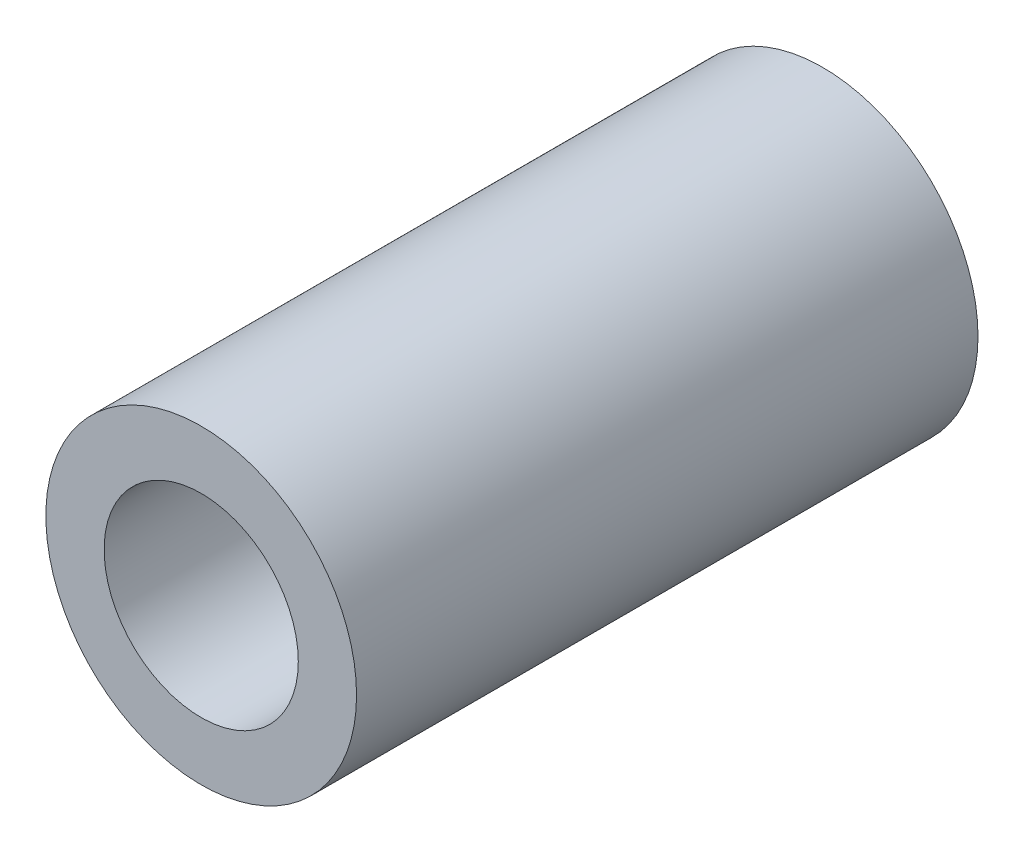
ISO-10303-21;
HEADER;
FILE_DESCRIPTION(('STEP AP214'),'2;1');
FILE_NAME('part.step','',(''),(''),'','','');
FILE_SCHEMA(('AUTOMOTIVE_DESIGN { 1 0 10303 214 1 1 1 1 }'));
ENDSEC;
DATA;
#1=APPLICATION_CONTEXT('core data for automotive mechanical design processes');
#2=APPLICATION_PROTOCOL_DEFINITION('international standard','automotive_design',2000,#1);
#3=PRODUCT_CONTEXT('',#1,'mechanical');
#4=PRODUCT('Part','Part','',(#3));
#5=PRODUCT_RELATED_PRODUCT_CATEGORY('part','',(#4));
#6=PRODUCT_DEFINITION_FORMATION('','',#4);
#7=PRODUCT_DEFINITION_CONTEXT('part definition',#1,'design');
#8=PRODUCT_DEFINITION('design','',#6,#7);
#9=PRODUCT_DEFINITION_SHAPE('','',#8);
#10=(LENGTH_UNIT() NAMED_UNIT(*) SI_UNIT(.MILLI.,.METRE.));
#11=(NAMED_UNIT(*) PLANE_ANGLE_UNIT() SI_UNIT($,.RADIAN.));
#12=(NAMED_UNIT(*) SI_UNIT($,.STERADIAN.) SOLID_ANGLE_UNIT());
#13=UNCERTAINTY_MEASURE_WITH_UNIT(LENGTH_MEASURE(1.E-05),#10,'distance_accuracy_value','');
#14=(GEOMETRIC_REPRESENTATION_CONTEXT(3) GLOBAL_UNCERTAINTY_ASSIGNED_CONTEXT((#13)) GLOBAL_UNIT_ASSIGNED_CONTEXT((#10,
#11,#12)) REPRESENTATION_CONTEXT('',''));
#15=CARTESIAN_POINT('',(0.,0.,0.));
#16=DIRECTION('',(0.,0.,1.));
#17=DIRECTION('',(1.,0.,0.));
#18=AXIS2_PLACEMENT_3D('',#15,#16,#17);
#19=CARTESIAN_POINT('',(0.,0.,6.35));
#20=DIRECTION('',(0.,0.,-1.));
#21=DIRECTION('',(-1.,0.,0.));
#22=AXIS2_PLACEMENT_3D('',#19,#20,#21);
#23=CYLINDRICAL_SURFACE('',#22,1.5875);
#24=CARTESIAN_POINT('',(0.,0.,6.35));
#25=DIRECTION('',(0.,0.,1.));
#26=DIRECTION('',(1.,0.,0.));
#27=AXIS2_PLACEMENT_3D('',#24,#25,#26);
#28=CIRCLE('',#27,1.5875);
#29=CARTESIAN_POINT('',(1.5875,0.,6.35));
#30=VERTEX_POINT('',#29);
#31=EDGE_CURVE('E10',#30,#30,#28,.T.);
#32=ORIENTED_EDGE('',*,*,#31,.F.);
#33=EDGE_LOOP('',(#32));
#34=FACE_BOUND('',#33,.T.);
#35=CARTESIAN_POINT('',(0.,0.,0.));
#36=DIRECTION('',(0.,0.,1.));
#37=DIRECTION('',(1.,0.,0.));
#38=AXIS2_PLACEMENT_3D('',#35,#36,#37);
#39=CIRCLE('',#38,1.5875);
#40=CARTESIAN_POINT('',(1.5875,0.,0.));
#41=VERTEX_POINT('',#40);
#42=EDGE_CURVE('E36',#41,#41,#39,.T.);
#43=ORIENTED_EDGE('',*,*,#42,.T.);
#44=EDGE_LOOP('',(#43));
#45=FACE_BOUND('',#44,.T.);
#46=ADVANCED_FACE('F33',(#34,#45),#23,.T.);
#47=CARTESIAN_POINT('',(0.,0.,6.35));
#48=DIRECTION('',(0.,0.,1.));
#49=DIRECTION('',(1.,0.,0.));
#50=AXIS2_PLACEMENT_3D('',#47,#48,#49);
#51=PLANE('',#50);
#52=CARTESIAN_POINT('',(0.,0.,6.35));
#53=DIRECTION('',(0.,0.,1.));
#54=DIRECTION('',(1.,0.,0.));
#55=AXIS2_PLACEMENT_3D('',#52,#53,#54);
#56=CIRCLE('',#55,0.9921875);
#57=CARTESIAN_POINT('',(0.9921875,0.,6.35));
#58=VERTEX_POINT('',#57);
#59=EDGE_CURVE('E47',#58,#58,#56,.T.);
#60=ORIENTED_EDGE('',*,*,#59,.F.);
#61=EDGE_LOOP('',(#60));
#62=FACE_BOUND('',#61,.T.);
#63=ORIENTED_EDGE('',*,*,#31,.T.);
#64=EDGE_LOOP('',(#63));
#65=FACE_BOUND('',#64,.T.);
#66=ADVANCED_FACE('F54',(#62,#65),#51,.T.);
#67=CARTESIAN_POINT('',(0.,0.,0.));
#68=DIRECTION('',(0.,0.,1.));
#69=DIRECTION('',(1.,0.,0.));
#70=AXIS2_PLACEMENT_3D('',#67,#68,#69);
#71=PLANE('',#70);
#72=CARTESIAN_POINT('',(0.,0.,0.));
#73=DIRECTION('',(0.,0.,1.));
#74=DIRECTION('',(1.,0.,0.));
#75=AXIS2_PLACEMENT_3D('',#72,#73,#74);
#76=CIRCLE('',#75,0.9921875);
#77=CARTESIAN_POINT('',(0.9921875,0.,0.));
#78=VERTEX_POINT('',#77);
#79=EDGE_CURVE('E43',#78,#78,#76,.F.);
#80=ORIENTED_EDGE('',*,*,#79,.F.);
#81=EDGE_LOOP('',(#80));
#82=FACE_BOUND('',#81,.T.);
#83=ORIENTED_EDGE('',*,*,#42,.F.);
#84=EDGE_LOOP('',(#83));
#85=FACE_BOUND('',#84,.T.);
#86=ADVANCED_FACE('F56',(#82,#85),#71,.F.);
#87=CARTESIAN_POINT('',(0.,0.,-0.00100000000000013));
#88=DIRECTION('',(0.,0.,1.));
#89=DIRECTION('',(1.,0.,0.));
#90=AXIS2_PLACEMENT_3D('',#87,#88,#89);
#91=CYLINDRICAL_SURFACE('',#90,0.9921875);
#92=ORIENTED_EDGE('',*,*,#59,.T.);
#93=EDGE_LOOP('',(#92));
#94=FACE_BOUND('',#93,.T.);
#95=ORIENTED_EDGE('',*,*,#79,.T.);
#96=EDGE_LOOP('',(#95));
#97=FACE_BOUND('',#96,.T.);
#98=ADVANCED_FACE('F51',(#94,#97),#91,.F.);
#99=CLOSED_SHELL('',(#46,#66,#86,#98));
#100=MANIFOLD_SOLID_BREP('B2',#99);
#101=ADVANCED_BREP_SHAPE_REPRESENTATION('',(#18,#100),#14);
#102=SHAPE_DEFINITION_REPRESENTATION(#9,#101);
ENDSEC;
END-ISO-10303-21;
